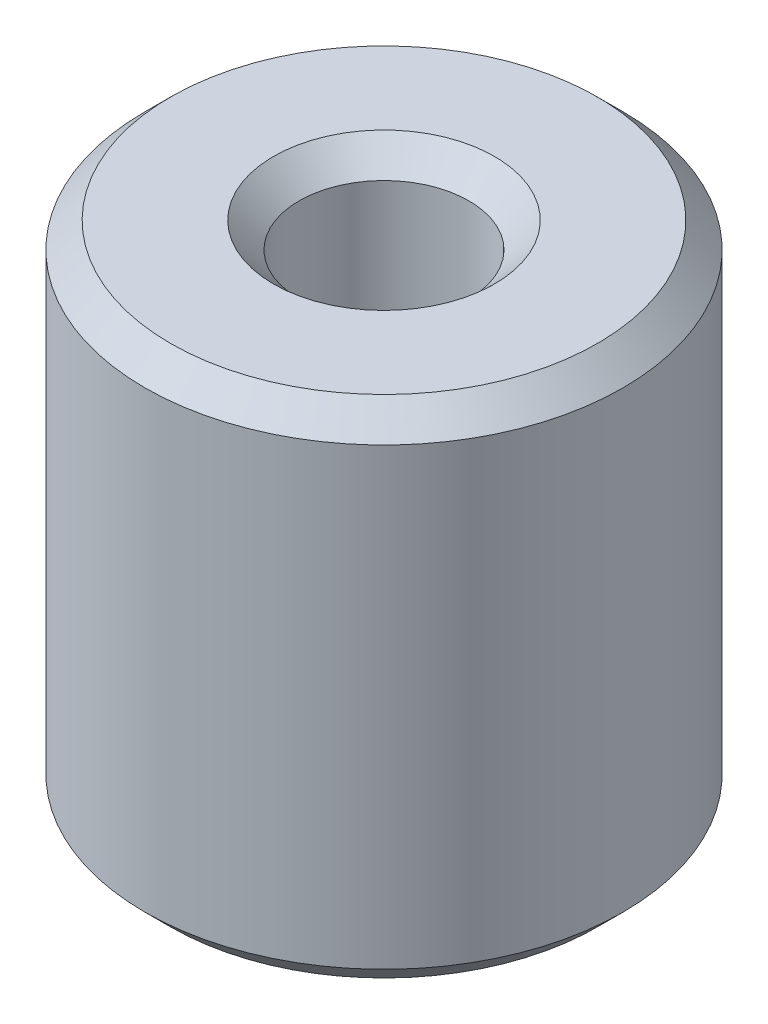
ISO-10303-21;
HEADER;
FILE_DESCRIPTION(('STEP AP214'),'2;1');
FILE_NAME('part.step','',(''),(''),'','','');
FILE_SCHEMA(('AUTOMOTIVE_DESIGN { 1 0 10303 214 1 1 1 1 }'));
ENDSEC;
DATA;
#1=APPLICATION_CONTEXT('core data for automotive mechanical design processes');
#2=APPLICATION_PROTOCOL_DEFINITION('international standard','automotive_design',2000,#1);
#3=PRODUCT_CONTEXT('',#1,'mechanical');
#4=PRODUCT('Part','Part','',(#3));
#5=PRODUCT_RELATED_PRODUCT_CATEGORY('part','',(#4));
#6=PRODUCT_DEFINITION_FORMATION('','',#4);
#7=PRODUCT_DEFINITION_CONTEXT('part definition',#1,'design');
#8=PRODUCT_DEFINITION('design','',#6,#7);
#9=PRODUCT_DEFINITION_SHAPE('','',#8);
#10=(LENGTH_UNIT() NAMED_UNIT(*) SI_UNIT(.MILLI.,.METRE.));
#11=(NAMED_UNIT(*) PLANE_ANGLE_UNIT() SI_UNIT($,.RADIAN.));
#12=(NAMED_UNIT(*) SI_UNIT($,.STERADIAN.) SOLID_ANGLE_UNIT());
#13=UNCERTAINTY_MEASURE_WITH_UNIT(LENGTH_MEASURE(1.E-05),#10,'distance_accuracy_value','');
#14=(GEOMETRIC_REPRESENTATION_CONTEXT(3) GLOBAL_UNCERTAINTY_ASSIGNED_CONTEXT((#13)) GLOBAL_UNIT_ASSIGNED_CONTEXT((#10,
#11,#12)) REPRESENTATION_CONTEXT('',''));
#15=CARTESIAN_POINT('',(0.,0.,0.));
#16=DIRECTION('',(0.,0.,1.));
#17=DIRECTION('',(1.,0.,0.));
#18=AXIS2_PLACEMENT_3D('',#15,#16,#17);
#19=CARTESIAN_POINT('',(0.,10.5674920030169,0.));
#20=DIRECTION('',(0.,-1.,0.));
#21=DIRECTION('',(0.,0.,-1.));
#22=AXIS2_PLACEMENT_3D('',#19,#20,#21);
#23=CYLINDRICAL_SURFACE('',#22,5.);
#24=CARTESIAN_POINT('',(0.,0.535906302858538,0.));
#25=DIRECTION('',(0.,1.,0.));
#26=DIRECTION('',(0.,0.,1.));
#27=AXIS2_PLACEMENT_3D('',#24,#25,#26);
#28=CIRCLE('',#27,5.);
#29=CARTESIAN_POINT('',(0.,0.535906302858538,5.));
#30=VERTEX_POINT('',#29);
#31=EDGE_CURVE('E10',#30,#30,#28,.T.);
#32=ORIENTED_EDGE('',*,*,#31,.T.);
#33=EDGE_LOOP('',(#32));
#34=FACE_BOUND('',#33,.T.);
#35=CARTESIAN_POINT('',(0.,10.0315857001584,0.));
#36=DIRECTION('',(0.,1.,0.));
#37=DIRECTION('',(0.,0.,1.));
#38=AXIS2_PLACEMENT_3D('',#35,#36,#37);
#39=CIRCLE('',#38,5.);
#40=CARTESIAN_POINT('',(0.,10.0315857001584,5.));
#41=VERTEX_POINT('',#40);
#42=EDGE_CURVE('E50',#41,#41,#39,.F.);
#43=ORIENTED_EDGE('',*,*,#42,.T.);
#44=EDGE_LOOP('',(#43));
#45=FACE_BOUND('',#44,.T.);
#46=ADVANCED_FACE('F39',(#34,#45),#23,.T.);
#47=CARTESIAN_POINT('',(0.,10.5674920030169,0.));
#48=DIRECTION('',(0.,1.,0.));
#49=DIRECTION('',(0.,0.,1.));
#50=AXIS2_PLACEMENT_3D('',#47,#48,#49);
#51=PLANE('',#50);
#52=CARTESIAN_POINT('',(0.,10.5674920030169,0.));
#53=DIRECTION('',(0.,1.,0.));
#54=DIRECTION('',(0.,0.,1.));
#55=AXIS2_PLACEMENT_3D('',#52,#53,#54);
#56=CIRCLE('',#55,2.31120587342169);
#57=CARTESIAN_POINT('',(0.,10.5674920030169,2.31120587342169));
#58=VERTEX_POINT('',#57);
#59=EDGE_CURVE('E58',#58,#58,#56,.F.);
#60=ORIENTED_EDGE('',*,*,#59,.T.);
#61=EDGE_LOOP('',(#60));
#62=FACE_BOUND('',#61,.T.);
#63=CARTESIAN_POINT('',(0.,10.5674920030169,0.));
#64=DIRECTION('',(0.,1.,0.));
#65=DIRECTION('',(0.,0.,1.));
#66=AXIS2_PLACEMENT_3D('',#63,#64,#65);
#67=CIRCLE('',#66,4.46409369714146);
#68=CARTESIAN_POINT('',(0.,10.5674920030169,4.46409369714146));
#69=VERTEX_POINT('',#68);
#70=EDGE_CURVE('E61',#69,#69,#67,.T.);
#71=ORIENTED_EDGE('',*,*,#70,.T.);
#72=EDGE_LOOP('',(#71));
#73=FACE_BOUND('',#72,.T.);
#74=ADVANCED_FACE('F88',(#62,#73),#51,.T.);
#75=CARTESIAN_POINT('',(0.,0.,0.));
#76=DIRECTION('',(0.,1.,0.));
#77=DIRECTION('',(0.,0.,1.));
#78=AXIS2_PLACEMENT_3D('',#75,#76,#77);
#79=PLANE('',#78);
#80=CARTESIAN_POINT('',(0.,0.,0.));
#81=DIRECTION('',(0.,1.,0.));
#82=DIRECTION('',(0.,0.,1.));
#83=AXIS2_PLACEMENT_3D('',#80,#81,#82);
#84=CIRCLE('',#83,2.31120587342169);
#85=CARTESIAN_POINT('',(0.,0.,2.31120587342169));
#86=VERTEX_POINT('',#85);
#87=EDGE_CURVE('E51',#86,#86,#84,.T.);
#88=ORIENTED_EDGE('',*,*,#87,.T.);
#89=EDGE_LOOP('',(#88));
#90=FACE_BOUND('',#89,.T.);
#91=CARTESIAN_POINT('',(0.,0.,0.));
#92=DIRECTION('',(0.,1.,0.));
#93=DIRECTION('',(0.,0.,1.));
#94=AXIS2_PLACEMENT_3D('',#91,#92,#93);
#95=CIRCLE('',#94,4.46409369714146);
#96=CARTESIAN_POINT('',(0.,0.,4.46409369714146));
#97=VERTEX_POINT('',#96);
#98=EDGE_CURVE('E54',#97,#97,#95,.F.);
#99=ORIENTED_EDGE('',*,*,#98,.T.);
#100=EDGE_LOOP('',(#99));
#101=FACE_BOUND('',#100,.T.);
#102=ADVANCED_FACE('F83',(#90,#101),#79,.F.);
#103=CARTESIAN_POINT('',(0.,10.5674920030169,0.));
#104=DIRECTION('',(0.,-1.,0.));
#105=DIRECTION('',(0.,0.,-1.));
#106=AXIS2_PLACEMENT_3D('',#103,#104,#105);
#107=CYLINDRICAL_SURFACE('',#106,1.77529957056315);
#108=CARTESIAN_POINT('',(0.,10.0315857001584,0.));
#109=DIRECTION('',(0.,1.,0.));
#110=DIRECTION('',(0.,0.,1.));
#111=AXIS2_PLACEMENT_3D('',#108,#109,#110);
#112=CIRCLE('',#111,1.77529957056315);
#113=CARTESIAN_POINT('',(0.,10.0315857001584,1.77529957056315));
#114=VERTEX_POINT('',#113);
#115=EDGE_CURVE('E67',#114,#114,#112,.T.);
#116=ORIENTED_EDGE('',*,*,#115,.T.);
#117=EDGE_LOOP('',(#116));
#118=FACE_BOUND('',#117,.T.);
#119=CARTESIAN_POINT('',(0.,0.535906302858545,0.));
#120=DIRECTION('',(0.,1.,0.));
#121=DIRECTION('',(0.,0.,1.));
#122=AXIS2_PLACEMENT_3D('',#119,#120,#121);
#123=CIRCLE('',#122,1.77529957056315);
#124=CARTESIAN_POINT('',(0.,0.535906302858545,1.77529957056315));
#125=VERTEX_POINT('',#124);
#126=EDGE_CURVE('E69',#125,#125,#123,.F.);
#127=ORIENTED_EDGE('',*,*,#126,.T.);
#128=EDGE_LOOP('',(#127));
#129=FACE_BOUND('',#128,.T.);
#130=ADVANCED_FACE('F71',(#118,#129),#107,.F.);
#131=CARTESIAN_POINT('',(0.,10.0315857001584,0.));
#132=DIRECTION('',(0.,1.,0.));
#133=DIRECTION('',(0.,0.,1.));
#134=AXIS2_PLACEMENT_3D('',#131,#132,#133);
#135=CONICAL_SURFACE('',#134,1.77529957056315,0.785398163397452);
#136=ORIENTED_EDGE('',*,*,#59,.F.);
#137=EDGE_LOOP('',(#136));
#138=FACE_BOUND('',#137,.T.);
#139=ORIENTED_EDGE('',*,*,#115,.F.);
#140=EDGE_LOOP('',(#139));
#141=FACE_BOUND('',#140,.T.);
#142=ADVANCED_FACE('F77',(#138,#141),#135,.F.);
#143=CARTESIAN_POINT('',(0.,0.,0.));
#144=DIRECTION('',(0.,-1.,0.));
#145=DIRECTION('',(0.,0.,-1.));
#146=AXIS2_PLACEMENT_3D('',#143,#144,#145);
#147=CONICAL_SURFACE('',#146,2.31120587342169,0.785398163397446);
#148=ORIENTED_EDGE('',*,*,#126,.F.);
#149=EDGE_LOOP('',(#148));
#150=FACE_BOUND('',#149,.T.);
#151=ORIENTED_EDGE('',*,*,#87,.F.);
#152=EDGE_LOOP('',(#151));
#153=FACE_BOUND('',#152,.T.);
#154=ADVANCED_FACE('F73',(#150,#153),#147,.F.);
#155=CARTESIAN_POINT('',(0.,0.535906302858538,0.));
#156=DIRECTION('',(0.,1.,0.));
#157=DIRECTION('',(0.,0.,1.));
#158=AXIS2_PLACEMENT_3D('',#155,#156,#157);
#159=CONICAL_SURFACE('',#158,5.,0.785398163397451);
#160=ORIENTED_EDGE('',*,*,#98,.F.);
#161=EDGE_LOOP('',(#160));
#162=FACE_BOUND('',#161,.T.);
#163=ORIENTED_EDGE('',*,*,#31,.F.);
#164=EDGE_LOOP('',(#163));
#165=FACE_BOUND('',#164,.T.);
#166=ADVANCED_FACE('F76',(#162,#165),#159,.T.);
#167=CARTESIAN_POINT('',(0.,10.5674920030169,0.));
#168=DIRECTION('',(0.,-1.,0.));
#169=DIRECTION('',(0.,0.,-1.));
#170=AXIS2_PLACEMENT_3D('',#167,#168,#169);
#171=CONICAL_SURFACE('',#170,4.46409369714146,0.785398163397444);
#172=ORIENTED_EDGE('',*,*,#42,.F.);
#173=EDGE_LOOP('',(#172));
#174=FACE_BOUND('',#173,.T.);
#175=ORIENTED_EDGE('',*,*,#70,.F.);
#176=EDGE_LOOP('',(#175));
#177=FACE_BOUND('',#176,.T.);
#178=ADVANCED_FACE('F45',(#174,#177),#171,.T.);
#179=CLOSED_SHELL('',(#46,#74,#102,#130,#142,#154,#166,#178));
#180=MANIFOLD_SOLID_BREP('B2',#179);
#181=ADVANCED_BREP_SHAPE_REPRESENTATION('',(#18,#180),#14);
#182=SHAPE_DEFINITION_REPRESENTATION(#9,#181);
ENDSEC;
END-ISO-10303-21;
